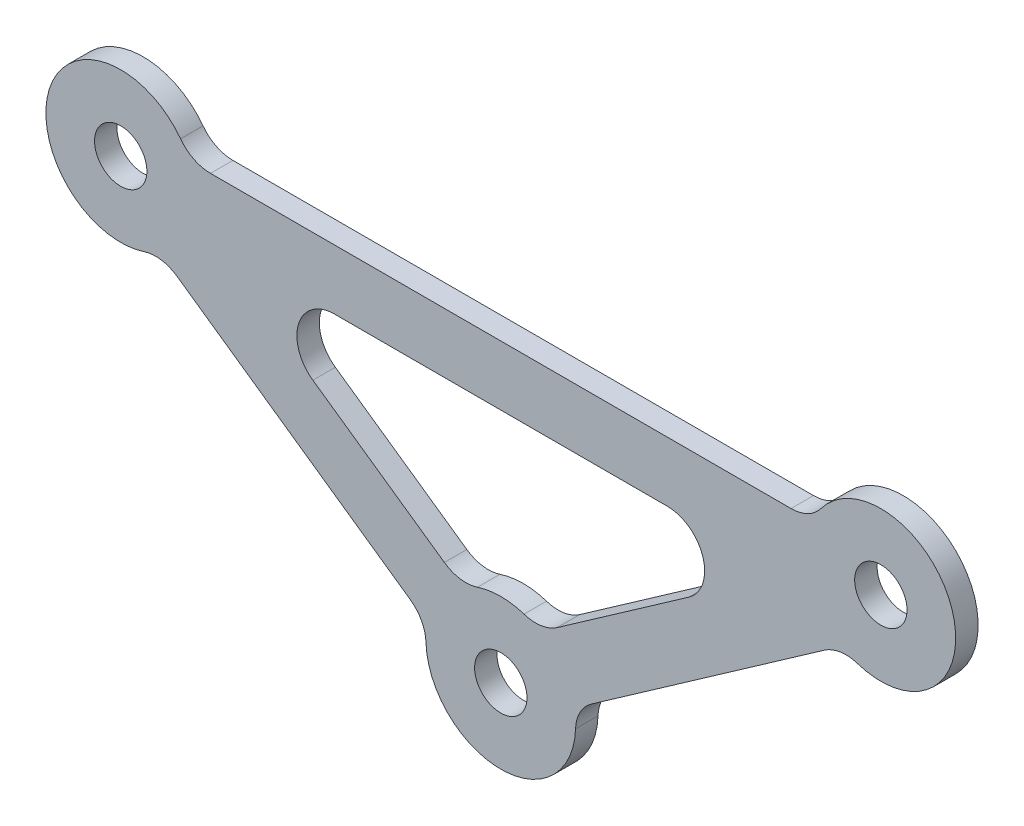
ISO-10303-21;
HEADER;
FILE_DESCRIPTION(('STEP AP214'),'2;1');
FILE_NAME('part.step','',(''),(''),'','','');
FILE_SCHEMA(('AUTOMOTIVE_DESIGN { 1 0 10303 214 1 1 1 1 }'));
ENDSEC;
DATA;
#1=APPLICATION_CONTEXT('core data for automotive mechanical design processes');
#2=APPLICATION_PROTOCOL_DEFINITION('international standard','automotive_design',2000,#1);
#3=PRODUCT_CONTEXT('',#1,'mechanical');
#4=PRODUCT('Part','Part','',(#3));
#5=PRODUCT_RELATED_PRODUCT_CATEGORY('part','',(#4));
#6=PRODUCT_DEFINITION_FORMATION('','',#4);
#7=PRODUCT_DEFINITION_CONTEXT('part definition',#1,'design');
#8=PRODUCT_DEFINITION('design','',#6,#7);
#9=PRODUCT_DEFINITION_SHAPE('','',#8);
#10=(LENGTH_UNIT() NAMED_UNIT(*) SI_UNIT(.MILLI.,.METRE.));
#11=(NAMED_UNIT(*) PLANE_ANGLE_UNIT() SI_UNIT($,.RADIAN.));
#12=(NAMED_UNIT(*) SI_UNIT($,.STERADIAN.) SOLID_ANGLE_UNIT());
#13=UNCERTAINTY_MEASURE_WITH_UNIT(LENGTH_MEASURE(1.E-05),#10,'distance_accuracy_value','');
#14=(GEOMETRIC_REPRESENTATION_CONTEXT(3) GLOBAL_UNCERTAINTY_ASSIGNED_CONTEXT((#13)) GLOBAL_UNIT_ASSIGNED_CONTEXT((#10,
#11,#12)) REPRESENTATION_CONTEXT('',''));
#15=CARTESIAN_POINT('',(0.,0.,0.));
#16=DIRECTION('',(0.,0.,1.));
#17=DIRECTION('',(1.,0.,0.));
#18=AXIS2_PLACEMENT_3D('',#15,#16,#17);
#19=CARTESIAN_POINT('',(38.7874267459177,9.,3.));
#20=DIRECTION('',(0.,0.,1.));
#21=DIRECTION('',(1.,0.,0.));
#22=AXIS2_PLACEMENT_3D('',#19,#20,#21);
#23=PLANE('',#22);
#24=CARTESIAN_POINT('',(-50.7874267459177,0.,3.));
#25=DIRECTION('',(0.,0.,1.));
#26=DIRECTION('',(1.,0.,0.));
#27=AXIS2_PLACEMENT_3D('',#24,#25,#26);
#28=CIRCLE('',#27,3.5);
#29=CARTESIAN_POINT('',(-47.2874267459177,0.,3.));
#30=VERTEX_POINT('',#29);
#31=EDGE_CURVE('E240',#30,#30,#28,.T.);
#32=ORIENTED_EDGE('',*,*,#31,.F.);
#33=EDGE_LOOP('',(#32));
#34=FACE_BOUND('',#33,.T.);
#35=CARTESIAN_POINT('',(38.7874267459177,9.,3.));
#36=DIRECTION('',(0.,0.,-1.));
#37=DIRECTION('',(1.,0.,0.));
#38=AXIS2_PLACEMENT_3D('',#35,#36,#37);
#39=CIRCLE('',#38,5.);
#40=CARTESIAN_POINT('',(42.7874267459177,6.,3.));
#41=VERTEX_POINT('',#40);
#42=CARTESIAN_POINT('',(38.7874267459177,4.,3.));
#43=VERTEX_POINT('',#42);
#44=EDGE_CURVE('E252',#41,#43,#39,.T.);
#45=ORIENTED_EDGE('',*,*,#44,.T.);
#46=DIRECTION('',(-1.,0.,0.));
#47=VECTOR('',#46,1.);
#48=CARTESIAN_POINT('',(-38.7874267459177,4.,3.));
#49=LINE('',#48,#47);
#50=CARTESIAN_POINT('',(-38.7874267459177,4.,3.));
#51=VERTEX_POINT('',#50);
#52=EDGE_CURVE('E255',#43,#51,#49,.T.);
#53=ORIENTED_EDGE('',*,*,#52,.T.);
#54=CARTESIAN_POINT('',(-38.7874267459177,9.,3.));
#55=DIRECTION('',(0.,0.,-1.));
#56=DIRECTION('',(-1.,0.,0.));
#57=AXIS2_PLACEMENT_3D('',#54,#55,#56);
#58=CIRCLE('',#57,5.);
#59=CARTESIAN_POINT('',(-42.7874267459177,6.,3.));
#60=VERTEX_POINT('',#59);
#61=EDGE_CURVE('E258',#51,#60,#58,.T.);
#62=ORIENTED_EDGE('',*,*,#61,.T.);
#63=CARTESIAN_POINT('',(-50.7874267459177,0.,3.));
#64=DIRECTION('',(0.,0.,1.));
#65=DIRECTION('',(1.,0.,0.));
#66=AXIS2_PLACEMENT_3D('',#63,#64,#65);
#67=CIRCLE('',#66,10.);
#68=CARTESIAN_POINT('',(-47.675669009712,-9.50352375654231,3.));
#69=VERTEX_POINT('',#68);
#70=EDGE_CURVE('E260',#60,#69,#67,.T.);
#71=ORIENTED_EDGE('',*,*,#70,.T.);
#72=CARTESIAN_POINT('',(-46.1197901416091,-14.2552856348135,3.));
#73=DIRECTION('',(0.,0.,-1.));
#74=DIRECTION('',(1.,0.,0.));
#75=AXIS2_PLACEMENT_3D('',#72,#73,#74);
#76=CIRCLE('',#75,5.);
#77=CARTESIAN_POINT('',(-43.2519079598539,-10.1595254133685,3.));
#78=VERTEX_POINT('',#77);
#79=EDGE_CURVE('E262',#69,#78,#76,.T.);
#80=ORIENTED_EDGE('',*,*,#79,.T.);
#81=DIRECTION('',(0.819152044288995,-0.573576436351041,0.));
#82=VECTOR('',#81,1.);
#83=CARTESIAN_POINT('',(-12.1241302768721,-31.9554299947081,3.));
#84=LINE('',#83,#82);
#85=CARTESIAN_POINT('',(-12.1241302768721,-31.9554299947081,3.));
#86=VERTEX_POINT('',#85);
#87=EDGE_CURVE('E264',#78,#86,#84,.T.);
#88=ORIENTED_EDGE('',*,*,#87,.T.);
#89=CARTESIAN_POINT('',(-14.9920124586273,-36.051190216153,3.));
#90=DIRECTION('',(0.,0.,-1.));
#91=DIRECTION('',(-1.,0.,0.));
#92=AXIS2_PLACEMENT_3D('',#89,#90,#91);
#93=CIRCLE('',#92,5.);
#94=CARTESIAN_POINT('',(-9.9946749724182,-35.8880398286902,3.));
#95=VERTEX_POINT('',#94);
#96=EDGE_CURVE('E266',#86,#95,#93,.T.);
#97=ORIENTED_EDGE('',*,*,#96,.T.);
#98=CARTESIAN_POINT('',(0.,-35.5617390537646,3.));
#99=DIRECTION('',(0.,0.,1.));
#100=DIRECTION('',(1.,0.,0.));
#101=AXIS2_PLACEMENT_3D('',#98,#99,#100);
#102=CIRCLE('',#101,10.);
#103=CARTESIAN_POINT('',(9.99467497241822,-35.8880398286902,3.));
#104=VERTEX_POINT('',#103);
#105=EDGE_CURVE('E268',#95,#104,#102,.T.);
#106=ORIENTED_EDGE('',*,*,#105,.T.);
#107=CARTESIAN_POINT('',(14.9920124586273,-36.051190216153,3.));
#108=DIRECTION('',(0.,0.,-1.));
#109=DIRECTION('',(1.,0.,0.));
#110=AXIS2_PLACEMENT_3D('',#107,#108,#109);
#111=CIRCLE('',#110,5.);
#112=CARTESIAN_POINT('',(12.1241302768721,-31.9554299947081,3.));
#113=VERTEX_POINT('',#112);
#114=EDGE_CURVE('E270',#104,#113,#111,.T.);
#115=ORIENTED_EDGE('',*,*,#114,.T.);
#116=DIRECTION('',(0.819152044288995,0.573576436351042,0.));
#117=VECTOR('',#116,1.);
#118=CARTESIAN_POINT('',(43.2519079598539,-10.1595254133685,3.));
#119=LINE('',#118,#117);
#120=CARTESIAN_POINT('',(43.2519079598539,-10.1595254133685,3.));
#121=VERTEX_POINT('',#120);
#122=EDGE_CURVE('E272',#113,#121,#119,.T.);
#123=ORIENTED_EDGE('',*,*,#122,.T.);
#124=CARTESIAN_POINT('',(46.1197901416091,-14.2552856348135,3.));
#125=DIRECTION('',(0.,0.,-1.));
#126=DIRECTION('',(-1.,0.,0.));
#127=AXIS2_PLACEMENT_3D('',#124,#125,#126);
#128=CIRCLE('',#127,5.);
#129=CARTESIAN_POINT('',(47.675669009712,-9.5035237565423,3.));
#130=VERTEX_POINT('',#129);
#131=EDGE_CURVE('E274',#121,#130,#128,.T.);
#132=ORIENTED_EDGE('',*,*,#131,.T.);
#133=CARTESIAN_POINT('',(50.7874267459177,0.,3.));
#134=DIRECTION('',(0.,0.,1.));
#135=DIRECTION('',(1.,0.,0.));
#136=AXIS2_PLACEMENT_3D('',#133,#134,#135);
#137=CIRCLE('',#136,10.);
#138=EDGE_CURVE('E276',#130,#41,#137,.T.);
#139=ORIENTED_EDGE('',*,*,#138,.T.);
#140=EDGE_LOOP('',(#45,#53,#62,#71,#80,#88,#97,#106,#115,#123,#132,#139));
#141=FACE_BOUND('',#140,.T.);
#142=CARTESIAN_POINT('',(50.7874267459177,0.,3.));
#143=DIRECTION('',(0.,0.,1.));
#144=DIRECTION('',(1.,0.,0.));
#145=AXIS2_PLACEMENT_3D('',#142,#143,#144);
#146=CIRCLE('',#145,3.5);
#147=CARTESIAN_POINT('',(54.2874267459177,0.,3.));
#148=VERTEX_POINT('',#147);
#149=EDGE_CURVE('E246',#148,#148,#146,.T.);
#150=ORIENTED_EDGE('',*,*,#149,.F.);
#151=EDGE_LOOP('',(#150));
#152=FACE_BOUND('',#151,.T.);
#153=CARTESIAN_POINT('',(0.,-35.5617390537646,3.));
#154=DIRECTION('',(0.,0.,1.));
#155=DIRECTION('',(1.,0.,0.));
#156=AXIS2_PLACEMENT_3D('',#153,#154,#155);
#157=CIRCLE('',#156,3.5);
#158=CARTESIAN_POINT('',(3.50000000000001,-35.5617390537646,3.));
#159=VERTEX_POINT('',#158);
#160=EDGE_CURVE('E234',#159,#159,#157,.T.);
#161=ORIENTED_EDGE('',*,*,#160,.F.);
#162=EDGE_LOOP('',(#161));
#163=FACE_BOUND('',#162,.T.);
#164=DIRECTION('',(0.819152044288995,0.573576436351042,0.));
#165=VECTOR('',#164,1.);
#166=CARTESIAN_POINT('',(25.1109557064036,-13.0957602214451,3.));
#167=LINE('',#166,#165);
#168=CARTESIAN_POINT('',(7.53551878606379,-25.4022136403961,3.));
#169=VERTEX_POINT('',#168);
#170=CARTESIAN_POINT('',(25.1109557064036,-13.0957602214451,3.));
#171=VERTEX_POINT('',#170);
#172=EDGE_CURVE('E177',#169,#171,#167,.T.);
#173=ORIENTED_EDGE('',*,*,#172,.F.);
#174=CARTESIAN_POINT('',(4.66763660430858,-21.3064534189511,3.));
#175=DIRECTION('',(0.,0.,1.));
#176=DIRECTION('',(-1.,0.,0.));
#177=AXIS2_PLACEMENT_3D('',#174,#175,#176);
#178=CIRCLE('',#177,5.);
#179=CARTESIAN_POINT('',(3.11175773620572,-26.0582152972223,3.));
#180=VERTEX_POINT('',#179);
#181=EDGE_CURVE('E169',#180,#169,#178,.T.);
#182=ORIENTED_EDGE('',*,*,#181,.F.);
#183=CARTESIAN_POINT('',(0.,-35.5617390537646,3.));
#184=DIRECTION('',(0.,0.,-1.));
#185=DIRECTION('',(1.,0.,0.));
#186=AXIS2_PLACEMENT_3D('',#183,#184,#185);
#187=CIRCLE('',#186,10.);
#188=CARTESIAN_POINT('',(-3.1117577362057,-26.0582152972223,3.));
#189=VERTEX_POINT('',#188);
#190=EDGE_CURVE('E202',#189,#180,#187,.T.);
#191=ORIENTED_EDGE('',*,*,#190,.F.);
#192=CARTESIAN_POINT('',(-4.66763660430856,-21.3064534189511,3.));
#193=DIRECTION('',(0.,0.,1.));
#194=DIRECTION('',(1.,0.,0.));
#195=AXIS2_PLACEMENT_3D('',#192,#193,#194);
#196=CIRCLE('',#195,5.);
#197=CARTESIAN_POINT('',(-7.53551878606377,-25.4022136403961,3.));
#198=VERTEX_POINT('',#197);
#199=EDGE_CURVE('E200',#198,#189,#196,.T.);
#200=ORIENTED_EDGE('',*,*,#199,.F.);
#201=DIRECTION('',(0.819152044288995,-0.573576436351041,0.));
#202=VECTOR('',#201,1.);
#203=CARTESIAN_POINT('',(-7.53551878606377,-25.4022136403961,3.));
#204=LINE('',#203,#202);
#205=CARTESIAN_POINT('',(-25.1109557064035,-13.0957602214451,3.));
#206=VERTEX_POINT('',#205);
#207=EDGE_CURVE('E198',#206,#198,#204,.T.);
#208=ORIENTED_EDGE('',*,*,#207,.F.);
#209=CARTESIAN_POINT('',(-22.2430735246485,-9.00000000000001,3.));
#210=DIRECTION('',(0.,0.,1.));
#211=DIRECTION('',(1.,0.,0.));
#212=AXIS2_PLACEMENT_3D('',#209,#210,#211);
#213=CIRCLE('',#212,5.);
#214=CARTESIAN_POINT('',(-22.2430735246483,-4.,3.));
#215=VERTEX_POINT('',#214);
#216=EDGE_CURVE('E196',#215,#206,#213,.T.);
#217=ORIENTED_EDGE('',*,*,#216,.F.);
#218=DIRECTION('',(-1.,0.,0.));
#219=VECTOR('',#218,1.);
#220=CARTESIAN_POINT('',(-22.2430735246483,-4.,3.));
#221=LINE('',#220,#219);
#222=CARTESIAN_POINT('',(22.2430735246483,-4.,3.));
#223=VERTEX_POINT('',#222);
#224=EDGE_CURVE('E192',#223,#215,#221,.T.);
#225=ORIENTED_EDGE('',*,*,#224,.F.);
#226=CARTESIAN_POINT('',(22.2430735246485,-9.,3.));
#227=DIRECTION('',(0.,0.,1.));
#228=DIRECTION('',(-1.,0.,0.));
#229=AXIS2_PLACEMENT_3D('',#226,#227,#228);
#230=CIRCLE('',#229,5.);
#231=EDGE_CURVE('E190',#171,#223,#230,.T.);
#232=ORIENTED_EDGE('',*,*,#231,.F.);
#233=EDGE_LOOP('',(#173,#182,#191,#200,#208,#217,#225,#232));
#234=FACE_BOUND('',#233,.T.);
#235=ADVANCED_FACE('F32',(#34,#141,#152,#163,#234),#23,.T.);
#236=CARTESIAN_POINT('',(38.7874267459177,9.,0.));
#237=DIRECTION('',(0.,0.,1.));
#238=DIRECTION('',(1.,0.,0.));
#239=AXIS2_PLACEMENT_3D('',#236,#237,#238);
#240=PLANE('',#239);
#241=CARTESIAN_POINT('',(0.,-35.5617390537646,0.));
#242=DIRECTION('',(0.,0.,1.));
#243=DIRECTION('',(1.,0.,0.));
#244=AXIS2_PLACEMENT_3D('',#241,#242,#243);
#245=CIRCLE('',#244,3.5);
#246=CARTESIAN_POINT('',(3.50000000000001,-35.5617390537646,0.));
#247=VERTEX_POINT('',#246);
#248=EDGE_CURVE('E185',#247,#247,#245,.T.);
#249=ORIENTED_EDGE('',*,*,#248,.T.);
#250=EDGE_LOOP('',(#249));
#251=FACE_BOUND('',#250,.T.);
#252=CARTESIAN_POINT('',(-50.7874267459177,0.,0.));
#253=DIRECTION('',(0.,0.,1.));
#254=DIRECTION('',(1.,0.,0.));
#255=AXIS2_PLACEMENT_3D('',#252,#253,#254);
#256=CIRCLE('',#255,3.5);
#257=CARTESIAN_POINT('',(-47.2874267459177,0.,0.));
#258=VERTEX_POINT('',#257);
#259=EDGE_CURVE('E237',#258,#258,#256,.T.);
#260=ORIENTED_EDGE('',*,*,#259,.T.);
#261=EDGE_LOOP('',(#260));
#262=FACE_BOUND('',#261,.T.);
#263=CARTESIAN_POINT('',(50.7874267459177,0.,0.));
#264=DIRECTION('',(0.,0.,1.));
#265=DIRECTION('',(1.,0.,0.));
#266=AXIS2_PLACEMENT_3D('',#263,#264,#265);
#267=CIRCLE('',#266,3.5);
#268=CARTESIAN_POINT('',(54.2874267459177,0.,0.));
#269=VERTEX_POINT('',#268);
#270=EDGE_CURVE('E243',#269,#269,#267,.T.);
#271=ORIENTED_EDGE('',*,*,#270,.T.);
#272=EDGE_LOOP('',(#271));
#273=FACE_BOUND('',#272,.T.);
#274=CARTESIAN_POINT('',(38.7874267459177,9.,0.));
#275=DIRECTION('',(0.,0.,-1.));
#276=DIRECTION('',(1.,0.,0.));
#277=AXIS2_PLACEMENT_3D('',#274,#275,#276);
#278=CIRCLE('',#277,5.);
#279=CARTESIAN_POINT('',(42.7874267459177,6.,0.));
#280=VERTEX_POINT('',#279);
#281=CARTESIAN_POINT('',(38.7874267459177,4.,0.));
#282=VERTEX_POINT('',#281);
#283=EDGE_CURVE('E249',#280,#282,#278,.T.);
#284=ORIENTED_EDGE('',*,*,#283,.F.);
#285=CARTESIAN_POINT('',(50.7874267459177,0.,0.));
#286=DIRECTION('',(0.,0.,1.));
#287=DIRECTION('',(1.,0.,0.));
#288=AXIS2_PLACEMENT_3D('',#285,#286,#287);
#289=CIRCLE('',#288,10.);
#290=CARTESIAN_POINT('',(47.675669009712,-9.5035237565423,0.));
#291=VERTEX_POINT('',#290);
#292=EDGE_CURVE('E256',#291,#280,#289,.T.);
#293=ORIENTED_EDGE('',*,*,#292,.F.);
#294=CARTESIAN_POINT('',(46.1197901416091,-14.2552856348135,0.));
#295=DIRECTION('',(0.,0.,-1.));
#296=DIRECTION('',(-1.,0.,0.));
#297=AXIS2_PLACEMENT_3D('',#294,#295,#296);
#298=CIRCLE('',#297,5.);
#299=CARTESIAN_POINT('',(43.2519079598539,-10.1595254133685,0.));
#300=VERTEX_POINT('',#299);
#301=EDGE_CURVE('E299',#300,#291,#298,.T.);
#302=ORIENTED_EDGE('',*,*,#301,.F.);
#303=DIRECTION('',(0.819152044288995,0.573576436351042,0.));
#304=VECTOR('',#303,1.);
#305=CARTESIAN_POINT('',(43.2519079598539,-10.1595254133685,0.));
#306=LINE('',#305,#304);
#307=CARTESIAN_POINT('',(12.1241302768721,-31.9554299947081,0.));
#308=VERTEX_POINT('',#307);
#309=EDGE_CURVE('E297',#308,#300,#306,.T.);
#310=ORIENTED_EDGE('',*,*,#309,.F.);
#311=CARTESIAN_POINT('',(14.9920124586273,-36.051190216153,0.));
#312=DIRECTION('',(0.,0.,-1.));
#313=DIRECTION('',(1.,0.,0.));
#314=AXIS2_PLACEMENT_3D('',#311,#312,#313);
#315=CIRCLE('',#314,5.);
#316=CARTESIAN_POINT('',(9.99467497241822,-35.8880398286902,0.));
#317=VERTEX_POINT('',#316);
#318=EDGE_CURVE('E295',#317,#308,#315,.T.);
#319=ORIENTED_EDGE('',*,*,#318,.F.);
#320=CARTESIAN_POINT('',(0.,-35.5617390537646,0.));
#321=DIRECTION('',(0.,0.,1.));
#322=DIRECTION('',(1.,0.,0.));
#323=AXIS2_PLACEMENT_3D('',#320,#321,#322);
#324=CIRCLE('',#323,10.);
#325=CARTESIAN_POINT('',(-9.9946749724182,-35.8880398286902,0.));
#326=VERTEX_POINT('',#325);
#327=EDGE_CURVE('E293',#326,#317,#324,.T.);
#328=ORIENTED_EDGE('',*,*,#327,.F.);
#329=CARTESIAN_POINT('',(-14.9920124586273,-36.051190216153,0.));
#330=DIRECTION('',(0.,0.,-1.));
#331=DIRECTION('',(-1.,0.,0.));
#332=AXIS2_PLACEMENT_3D('',#329,#330,#331);
#333=CIRCLE('',#332,5.);
#334=CARTESIAN_POINT('',(-12.1241302768721,-31.9554299947081,0.));
#335=VERTEX_POINT('',#334);
#336=EDGE_CURVE('E291',#335,#326,#333,.T.);
#337=ORIENTED_EDGE('',*,*,#336,.F.);
#338=DIRECTION('',(0.819152044288995,-0.573576436351041,0.));
#339=VECTOR('',#338,1.);
#340=CARTESIAN_POINT('',(-12.1241302768721,-31.9554299947081,0.));
#341=LINE('',#340,#339);
#342=CARTESIAN_POINT('',(-43.2519079598539,-10.1595254133685,0.));
#343=VERTEX_POINT('',#342);
#344=EDGE_CURVE('E289',#343,#335,#341,.T.);
#345=ORIENTED_EDGE('',*,*,#344,.F.);
#346=CARTESIAN_POINT('',(-46.1197901416091,-14.2552856348135,0.));
#347=DIRECTION('',(0.,0.,-1.));
#348=DIRECTION('',(1.,0.,0.));
#349=AXIS2_PLACEMENT_3D('',#346,#347,#348);
#350=CIRCLE('',#349,5.);
#351=CARTESIAN_POINT('',(-47.675669009712,-9.50352375654231,0.));
#352=VERTEX_POINT('',#351);
#353=EDGE_CURVE('E287',#352,#343,#350,.T.);
#354=ORIENTED_EDGE('',*,*,#353,.F.);
#355=CARTESIAN_POINT('',(-50.7874267459177,0.,0.));
#356=DIRECTION('',(0.,0.,1.));
#357=DIRECTION('',(1.,0.,0.));
#358=AXIS2_PLACEMENT_3D('',#355,#356,#357);
#359=CIRCLE('',#358,10.);
#360=CARTESIAN_POINT('',(-42.7874267459177,6.,0.));
#361=VERTEX_POINT('',#360);
#362=EDGE_CURVE('E285',#361,#352,#359,.T.);
#363=ORIENTED_EDGE('',*,*,#362,.F.);
#364=CARTESIAN_POINT('',(-38.7874267459177,9.,0.));
#365=DIRECTION('',(0.,0.,-1.));
#366=DIRECTION('',(-1.,0.,0.));
#367=AXIS2_PLACEMENT_3D('',#364,#365,#366);
#368=CIRCLE('',#367,5.);
#369=CARTESIAN_POINT('',(-38.7874267459177,4.,0.));
#370=VERTEX_POINT('',#369);
#371=EDGE_CURVE('E283',#370,#361,#368,.T.);
#372=ORIENTED_EDGE('',*,*,#371,.F.);
#373=DIRECTION('',(-1.,0.,0.));
#374=VECTOR('',#373,1.);
#375=CARTESIAN_POINT('',(-38.7874267459177,4.,0.));
#376=LINE('',#375,#374);
#377=EDGE_CURVE('E281',#282,#370,#376,.T.);
#378=ORIENTED_EDGE('',*,*,#377,.F.);
#379=EDGE_LOOP('',(#284,#293,#302,#310,#319,#328,#337,#345,#354,#363,#372,#378));
#380=FACE_BOUND('',#379,.T.);
#381=CARTESIAN_POINT('',(4.66763660430858,-21.3064534189511,0.));
#382=DIRECTION('',(0.,0.,1.));
#383=DIRECTION('',(-1.,0.,0.));
#384=AXIS2_PLACEMENT_3D('',#381,#382,#383);
#385=CIRCLE('',#384,5.);
#386=CARTESIAN_POINT('',(3.11175773620572,-26.0582152972223,0.));
#387=VERTEX_POINT('',#386);
#388=CARTESIAN_POINT('',(7.53551878606379,-25.4022136403961,0.));
#389=VERTEX_POINT('',#388);
#390=EDGE_CURVE('E55',#387,#389,#385,.T.);
#391=ORIENTED_EDGE('',*,*,#390,.T.);
#392=DIRECTION('',(0.819152044288995,0.573576436351042,0.));
#393=VECTOR('',#392,1.);
#394=CARTESIAN_POINT('',(25.1109557064036,-13.0957602214451,0.));
#395=LINE('',#394,#393);
#396=CARTESIAN_POINT('',(25.1109557064036,-13.0957602214451,0.));
#397=VERTEX_POINT('',#396);
#398=EDGE_CURVE('E184',#389,#397,#395,.T.);
#399=ORIENTED_EDGE('',*,*,#398,.T.);
#400=CARTESIAN_POINT('',(22.2430735246485,-9.,0.));
#401=DIRECTION('',(0.,0.,1.));
#402=DIRECTION('',(-1.,0.,0.));
#403=AXIS2_PLACEMENT_3D('',#400,#401,#402);
#404=CIRCLE('',#403,5.);
#405=CARTESIAN_POINT('',(22.2430735246483,-4.,0.));
#406=VERTEX_POINT('',#405);
#407=EDGE_CURVE('E206',#397,#406,#404,.T.);
#408=ORIENTED_EDGE('',*,*,#407,.T.);
#409=DIRECTION('',(-1.,0.,0.));
#410=VECTOR('',#409,1.);
#411=CARTESIAN_POINT('',(-22.2430735246483,-4.,0.));
#412=LINE('',#411,#410);
#413=CARTESIAN_POINT('',(-22.2430735246483,-4.,0.));
#414=VERTEX_POINT('',#413);
#415=EDGE_CURVE('E209',#406,#414,#412,.T.);
#416=ORIENTED_EDGE('',*,*,#415,.T.);
#417=CARTESIAN_POINT('',(-22.2430735246485,-9.00000000000001,0.));
#418=DIRECTION('',(0.,0.,1.));
#419=DIRECTION('',(1.,0.,0.));
#420=AXIS2_PLACEMENT_3D('',#417,#418,#419);
#421=CIRCLE('',#420,5.);
#422=CARTESIAN_POINT('',(-25.1109557064035,-13.0957602214451,0.));
#423=VERTEX_POINT('',#422);
#424=EDGE_CURVE('E212',#414,#423,#421,.T.);
#425=ORIENTED_EDGE('',*,*,#424,.T.);
#426=DIRECTION('',(0.819152044288995,-0.573576436351041,0.));
#427=VECTOR('',#426,1.);
#428=CARTESIAN_POINT('',(-7.53551878606377,-25.4022136403961,0.));
#429=LINE('',#428,#427);
#430=CARTESIAN_POINT('',(-7.53551878606377,-25.4022136403961,0.));
#431=VERTEX_POINT('',#430);
#432=EDGE_CURVE('E215',#423,#431,#429,.T.);
#433=ORIENTED_EDGE('',*,*,#432,.T.);
#434=CARTESIAN_POINT('',(-4.66763660430856,-21.3064534189511,0.));
#435=DIRECTION('',(0.,0.,1.));
#436=DIRECTION('',(1.,0.,0.));
#437=AXIS2_PLACEMENT_3D('',#434,#435,#436);
#438=CIRCLE('',#437,5.);
#439=CARTESIAN_POINT('',(-3.1117577362057,-26.0582152972223,0.));
#440=VERTEX_POINT('',#439);
#441=EDGE_CURVE('E218',#431,#440,#438,.T.);
#442=ORIENTED_EDGE('',*,*,#441,.T.);
#443=CARTESIAN_POINT('',(0.,-35.5617390537646,0.));
#444=DIRECTION('',(0.,0.,-1.));
#445=DIRECTION('',(1.,0.,0.));
#446=AXIS2_PLACEMENT_3D('',#443,#444,#445);
#447=CIRCLE('',#446,10.);
#448=EDGE_CURVE('E178',#440,#387,#447,.T.);
#449=ORIENTED_EDGE('',*,*,#448,.T.);
#450=EDGE_LOOP('',(#391,#399,#408,#416,#425,#433,#442,#449));
#451=FACE_BOUND('',#450,.T.);
#452=ADVANCED_FACE('F341',(#251,#262,#273,#380,#451),#240,.F.);
#453=CARTESIAN_POINT('',(38.7874267459177,9.,3.));
#454=DIRECTION('',(0.,0.,-1.));
#455=DIRECTION('',(-1.,0.,0.));
#456=AXIS2_PLACEMENT_3D('',#453,#454,#455);
#457=CYLINDRICAL_SURFACE('',#456,5.);
#458=ORIENTED_EDGE('',*,*,#283,.T.);
#459=DIRECTION('',(0.,0.,-1.));
#460=VECTOR('',#459,1.);
#461=CARTESIAN_POINT('',(38.7874267459177,4.,3.));
#462=LINE('',#461,#460);
#463=EDGE_CURVE('E11',#43,#282,#462,.T.);
#464=ORIENTED_EDGE('',*,*,#463,.F.);
#465=ORIENTED_EDGE('',*,*,#44,.F.);
#466=DIRECTION('',(0.,0.,-1.));
#467=VECTOR('',#466,1.);
#468=CARTESIAN_POINT('',(42.7874267459177,6.,3.));
#469=LINE('',#468,#467);
#470=EDGE_CURVE('E278',#41,#280,#469,.T.);
#471=ORIENTED_EDGE('',*,*,#470,.T.);
#472=EDGE_LOOP('',(#458,#464,#465,#471));
#473=FACE_BOUND('',#472,.T.);
#474=ADVANCED_FACE('F34',(#473),#457,.F.);
#475=CARTESIAN_POINT('',(-38.7874267459177,4.,3.));
#476=DIRECTION('',(0.,-1.,0.));
#477=DIRECTION('',(1.,0.,0.));
#478=AXIS2_PLACEMENT_3D('',#475,#476,#477);
#479=PLANE('',#478);
#480=ORIENTED_EDGE('',*,*,#377,.T.);
#481=DIRECTION('',(0.,0.,-1.));
#482=VECTOR('',#481,1.);
#483=CARTESIAN_POINT('',(-38.7874267459177,4.,3.));
#484=LINE('',#483,#482);
#485=EDGE_CURVE('E40',#51,#370,#484,.T.);
#486=ORIENTED_EDGE('',*,*,#485,.F.);
#487=ORIENTED_EDGE('',*,*,#52,.F.);
#488=ORIENTED_EDGE('',*,*,#463,.T.);
#489=EDGE_LOOP('',(#480,#486,#487,#488));
#490=FACE_BOUND('',#489,.T.);
#491=ADVANCED_FACE('F359',(#490),#479,.F.);
#492=CARTESIAN_POINT('',(-38.7874267459177,9.,3.));
#493=DIRECTION('',(0.,0.,-1.));
#494=DIRECTION('',(-1.,0.,0.));
#495=AXIS2_PLACEMENT_3D('',#492,#493,#494);
#496=CYLINDRICAL_SURFACE('',#495,5.);
#497=ORIENTED_EDGE('',*,*,#371,.T.);
#498=DIRECTION('',(0.,0.,-1.));
#499=VECTOR('',#498,1.);
#500=CARTESIAN_POINT('',(-42.7874267459177,6.,3.));
#501=LINE('',#500,#499);
#502=EDGE_CURVE('E328',#60,#361,#501,.T.);
#503=ORIENTED_EDGE('',*,*,#502,.F.);
#504=ORIENTED_EDGE('',*,*,#61,.F.);
#505=ORIENTED_EDGE('',*,*,#485,.T.);
#506=EDGE_LOOP('',(#497,#503,#504,#505));
#507=FACE_BOUND('',#506,.T.);
#508=ADVANCED_FACE('F335',(#507),#496,.F.);
#509=CARTESIAN_POINT('',(-50.7874267459177,0.,3.));
#510=DIRECTION('',(0.,0.,-1.));
#511=DIRECTION('',(-1.,0.,0.));
#512=AXIS2_PLACEMENT_3D('',#509,#510,#511);
#513=CYLINDRICAL_SURFACE('',#512,10.);
#514=ORIENTED_EDGE('',*,*,#362,.T.);
#515=DIRECTION('',(0.,0.,-1.));
#516=VECTOR('',#515,1.);
#517=CARTESIAN_POINT('',(-47.675669009712,-9.50352375654231,3.));
#518=LINE('',#517,#516);
#519=EDGE_CURVE('E325',#69,#352,#518,.T.);
#520=ORIENTED_EDGE('',*,*,#519,.F.);
#521=ORIENTED_EDGE('',*,*,#70,.F.);
#522=ORIENTED_EDGE('',*,*,#502,.T.);
#523=EDGE_LOOP('',(#514,#520,#521,#522));
#524=FACE_BOUND('',#523,.T.);
#525=ADVANCED_FACE('F347',(#524),#513,.T.);
#526=CARTESIAN_POINT('',(-46.1197901416091,-14.2552856348135,3.));
#527=DIRECTION('',(0.,0.,-1.));
#528=DIRECTION('',(-1.,0.,0.));
#529=AXIS2_PLACEMENT_3D('',#526,#527,#528);
#530=CYLINDRICAL_SURFACE('',#529,5.);
#531=ORIENTED_EDGE('',*,*,#353,.T.);
#532=DIRECTION('',(0.,0.,-1.));
#533=VECTOR('',#532,1.);
#534=CARTESIAN_POINT('',(-43.2519079598539,-10.1595254133685,3.));
#535=LINE('',#534,#533);
#536=EDGE_CURVE('E322',#78,#343,#535,.T.);
#537=ORIENTED_EDGE('',*,*,#536,.F.);
#538=ORIENTED_EDGE('',*,*,#79,.F.);
#539=ORIENTED_EDGE('',*,*,#519,.T.);
#540=EDGE_LOOP('',(#531,#537,#538,#539));
#541=FACE_BOUND('',#540,.T.);
#542=ADVANCED_FACE('F351',(#541),#530,.F.);
#543=CARTESIAN_POINT('',(-12.1241302768721,-31.9554299947081,3.));
#544=DIRECTION('',(0.573576436351041,0.819152044288995,0.));
#545=DIRECTION('',(-0.819152044288995,0.573576436351041,0.));
#546=AXIS2_PLACEMENT_3D('',#543,#544,#545);
#547=PLANE('',#546);
#548=ORIENTED_EDGE('',*,*,#344,.T.);
#549=DIRECTION('',(0.,0.,-1.));
#550=VECTOR('',#549,1.);
#551=CARTESIAN_POINT('',(-12.1241302768721,-31.9554299947081,3.));
#552=LINE('',#551,#550);
#553=EDGE_CURVE('E319',#86,#335,#552,.T.);
#554=ORIENTED_EDGE('',*,*,#553,.F.);
#555=ORIENTED_EDGE('',*,*,#87,.F.);
#556=ORIENTED_EDGE('',*,*,#536,.T.);
#557=EDGE_LOOP('',(#548,#554,#555,#556));
#558=FACE_BOUND('',#557,.T.);
#559=ADVANCED_FACE('F392',(#558),#547,.F.);
#560=CARTESIAN_POINT('',(-14.9920124586273,-36.051190216153,3.));
#561=DIRECTION('',(0.,0.,-1.));
#562=DIRECTION('',(-1.,0.,0.));
#563=AXIS2_PLACEMENT_3D('',#560,#561,#562);
#564=CYLINDRICAL_SURFACE('',#563,5.);
#565=ORIENTED_EDGE('',*,*,#336,.T.);
#566=DIRECTION('',(0.,0.,-1.));
#567=VECTOR('',#566,1.);
#568=CARTESIAN_POINT('',(-9.9946749724182,-35.8880398286902,3.));
#569=LINE('',#568,#567);
#570=EDGE_CURVE('E316',#95,#326,#569,.T.);
#571=ORIENTED_EDGE('',*,*,#570,.F.);
#572=ORIENTED_EDGE('',*,*,#96,.F.);
#573=ORIENTED_EDGE('',*,*,#553,.T.);
#574=EDGE_LOOP('',(#565,#571,#572,#573));
#575=FACE_BOUND('',#574,.T.);
#576=ADVANCED_FACE('F390',(#575),#564,.F.);
#577=CARTESIAN_POINT('',(0.,-35.5617390537646,3.));
#578=DIRECTION('',(0.,0.,-1.));
#579=DIRECTION('',(-1.,0.,0.));
#580=AXIS2_PLACEMENT_3D('',#577,#578,#579);
#581=CYLINDRICAL_SURFACE('',#580,10.);
#582=ORIENTED_EDGE('',*,*,#327,.T.);
#583=DIRECTION('',(0.,0.,-1.));
#584=VECTOR('',#583,1.);
#585=CARTESIAN_POINT('',(9.99467497241822,-35.8880398286902,3.));
#586=LINE('',#585,#584);
#587=EDGE_CURVE('E313',#104,#317,#586,.T.);
#588=ORIENTED_EDGE('',*,*,#587,.F.);
#589=ORIENTED_EDGE('',*,*,#105,.F.);
#590=ORIENTED_EDGE('',*,*,#570,.T.);
#591=EDGE_LOOP('',(#582,#588,#589,#590));
#592=FACE_BOUND('',#591,.T.);
#593=ADVANCED_FACE('F386',(#592),#581,.T.);
#594=CARTESIAN_POINT('',(14.9920124586273,-36.051190216153,3.));
#595=DIRECTION('',(0.,0.,-1.));
#596=DIRECTION('',(-1.,0.,0.));
#597=AXIS2_PLACEMENT_3D('',#594,#595,#596);
#598=CYLINDRICAL_SURFACE('',#597,5.);
#599=ORIENTED_EDGE('',*,*,#318,.T.);
#600=DIRECTION('',(0.,0.,-1.));
#601=VECTOR('',#600,1.);
#602=CARTESIAN_POINT('',(12.1241302768721,-31.9554299947081,3.));
#603=LINE('',#602,#601);
#604=EDGE_CURVE('E310',#113,#308,#603,.T.);
#605=ORIENTED_EDGE('',*,*,#604,.F.);
#606=ORIENTED_EDGE('',*,*,#114,.F.);
#607=ORIENTED_EDGE('',*,*,#587,.T.);
#608=EDGE_LOOP('',(#599,#605,#606,#607));
#609=FACE_BOUND('',#608,.T.);
#610=ADVANCED_FACE('F381',(#609),#598,.F.);
#611=CARTESIAN_POINT('',(43.2519079598539,-10.1595254133685,3.));
#612=DIRECTION('',(-0.573576436351041,0.819152044288995,0.));
#613=DIRECTION('',(-0.819152044288995,-0.573576436351042,0.));
#614=AXIS2_PLACEMENT_3D('',#611,#612,#613);
#615=PLANE('',#614);
#616=ORIENTED_EDGE('',*,*,#309,.T.);
#617=DIRECTION('',(0.,0.,-1.));
#618=VECTOR('',#617,1.);
#619=CARTESIAN_POINT('',(43.2519079598539,-10.1595254133685,3.));
#620=LINE('',#619,#618);
#621=EDGE_CURVE('E307',#121,#300,#620,.T.);
#622=ORIENTED_EDGE('',*,*,#621,.F.);
#623=ORIENTED_EDGE('',*,*,#122,.F.);
#624=ORIENTED_EDGE('',*,*,#604,.T.);
#625=EDGE_LOOP('',(#616,#622,#623,#624));
#626=FACE_BOUND('',#625,.T.);
#627=ADVANCED_FACE('F375',(#626),#615,.F.);
#628=CARTESIAN_POINT('',(46.1197901416091,-14.2552856348135,3.));
#629=DIRECTION('',(0.,0.,-1.));
#630=DIRECTION('',(-1.,0.,0.));
#631=AXIS2_PLACEMENT_3D('',#628,#629,#630);
#632=CYLINDRICAL_SURFACE('',#631,5.);
#633=ORIENTED_EDGE('',*,*,#301,.T.);
#634=DIRECTION('',(0.,0.,-1.));
#635=VECTOR('',#634,1.);
#636=CARTESIAN_POINT('',(47.675669009712,-9.5035237565423,3.));
#637=LINE('',#636,#635);
#638=EDGE_CURVE('E304',#130,#291,#637,.T.);
#639=ORIENTED_EDGE('',*,*,#638,.F.);
#640=ORIENTED_EDGE('',*,*,#131,.F.);
#641=ORIENTED_EDGE('',*,*,#621,.T.);
#642=EDGE_LOOP('',(#633,#639,#640,#641));
#643=FACE_BOUND('',#642,.T.);
#644=ADVANCED_FACE('F371',(#643),#632,.F.);
#645=CARTESIAN_POINT('',(50.7874267459177,0.,3.));
#646=DIRECTION('',(0.,0.,-1.));
#647=DIRECTION('',(-1.,0.,0.));
#648=AXIS2_PLACEMENT_3D('',#645,#646,#647);
#649=CYLINDRICAL_SURFACE('',#648,10.);
#650=ORIENTED_EDGE('',*,*,#292,.T.);
#651=ORIENTED_EDGE('',*,*,#470,.F.);
#652=ORIENTED_EDGE('',*,*,#138,.F.);
#653=ORIENTED_EDGE('',*,*,#638,.T.);
#654=EDGE_LOOP('',(#650,#651,#652,#653));
#655=FACE_BOUND('',#654,.T.);
#656=ADVANCED_FACE('F366',(#655),#649,.T.);
#657=CARTESIAN_POINT('',(50.7874267459177,0.,3.));
#658=DIRECTION('',(0.,0.,-1.));
#659=DIRECTION('',(-1.,0.,0.));
#660=AXIS2_PLACEMENT_3D('',#657,#658,#659);
#661=CYLINDRICAL_SURFACE('',#660,3.5);
#662=ORIENTED_EDGE('',*,*,#149,.T.);
#663=EDGE_LOOP('',(#662));
#664=FACE_BOUND('',#663,.T.);
#665=ORIENTED_EDGE('',*,*,#270,.F.);
#666=EDGE_LOOP('',(#665));
#667=FACE_BOUND('',#666,.T.);
#668=ADVANCED_FACE('F411',(#664,#667),#661,.F.);
#669=CARTESIAN_POINT('',(-50.7874267459177,0.,3.));
#670=DIRECTION('',(0.,0.,-1.));
#671=DIRECTION('',(-1.,0.,0.));
#672=AXIS2_PLACEMENT_3D('',#669,#670,#671);
#673=CYLINDRICAL_SURFACE('',#672,3.5);
#674=ORIENTED_EDGE('',*,*,#31,.T.);
#675=EDGE_LOOP('',(#674));
#676=FACE_BOUND('',#675,.T.);
#677=ORIENTED_EDGE('',*,*,#259,.F.);
#678=EDGE_LOOP('',(#677));
#679=FACE_BOUND('',#678,.T.);
#680=ADVANCED_FACE('F449',(#676,#679),#673,.F.);
#681=CARTESIAN_POINT('',(0.,-35.5617390537646,3.));
#682=DIRECTION('',(0.,0.,-1.));
#683=DIRECTION('',(-1.,0.,0.));
#684=AXIS2_PLACEMENT_3D('',#681,#682,#683);
#685=CYLINDRICAL_SURFACE('',#684,3.5);
#686=ORIENTED_EDGE('',*,*,#160,.T.);
#687=EDGE_LOOP('',(#686));
#688=FACE_BOUND('',#687,.T.);
#689=ORIENTED_EDGE('',*,*,#248,.F.);
#690=EDGE_LOOP('',(#689));
#691=FACE_BOUND('',#690,.T.);
#692=ADVANCED_FACE('F456',(#688,#691),#685,.F.);
#693=CARTESIAN_POINT('',(4.66763660430858,-21.3064534189511,3.));
#694=DIRECTION('',(0.,0.,-1.));
#695=DIRECTION('',(-1.,0.,0.));
#696=AXIS2_PLACEMENT_3D('',#693,#694,#695);
#697=CYLINDRICAL_SURFACE('',#696,5.);
#698=ORIENTED_EDGE('',*,*,#390,.F.);
#699=DIRECTION('',(0.,0.,-1.));
#700=VECTOR('',#699,1.);
#701=CARTESIAN_POINT('',(3.11175773620572,-26.0582152972223,3.));
#702=LINE('',#701,#700);
#703=EDGE_CURVE('E173',#180,#387,#702,.T.);
#704=ORIENTED_EDGE('',*,*,#703,.F.);
#705=ORIENTED_EDGE('',*,*,#181,.T.);
#706=DIRECTION('',(0.,0.,-1.));
#707=VECTOR('',#706,1.);
#708=CARTESIAN_POINT('',(7.53551878606379,-25.4022136403961,3.));
#709=LINE('',#708,#707);
#710=EDGE_CURVE('E172',#169,#389,#709,.T.);
#711=ORIENTED_EDGE('',*,*,#710,.T.);
#712=EDGE_LOOP('',(#698,#704,#705,#711));
#713=FACE_BOUND('',#712,.T.);
#714=ADVANCED_FACE('F171',(#713),#697,.F.);
#715=CARTESIAN_POINT('',(25.1109557064036,-13.0957602214451,3.));
#716=DIRECTION('',(-0.573576436351042,0.819152044288995,0.));
#717=DIRECTION('',(-0.819152044288995,-0.573576436351042,0.));
#718=AXIS2_PLACEMENT_3D('',#715,#716,#717);
#719=PLANE('',#718);
#720=ORIENTED_EDGE('',*,*,#398,.F.);
#721=ORIENTED_EDGE('',*,*,#710,.F.);
#722=ORIENTED_EDGE('',*,*,#172,.T.);
#723=DIRECTION('',(0.,0.,-1.));
#724=VECTOR('',#723,1.);
#725=CARTESIAN_POINT('',(25.1109557064036,-13.0957602214451,3.));
#726=LINE('',#725,#724);
#727=EDGE_CURVE('E186',#171,#397,#726,.T.);
#728=ORIENTED_EDGE('',*,*,#727,.T.);
#729=EDGE_LOOP('',(#720,#721,#722,#728));
#730=FACE_BOUND('',#729,.T.);
#731=ADVANCED_FACE('F181',(#730),#719,.T.);
#732=CARTESIAN_POINT('',(22.2430735246485,-9.,3.));
#733=DIRECTION('',(0.,0.,-1.));
#734=DIRECTION('',(-1.,0.,0.));
#735=AXIS2_PLACEMENT_3D('',#732,#733,#734);
#736=CYLINDRICAL_SURFACE('',#735,5.);
#737=ORIENTED_EDGE('',*,*,#407,.F.);
#738=ORIENTED_EDGE('',*,*,#727,.F.);
#739=ORIENTED_EDGE('',*,*,#231,.T.);
#740=DIRECTION('',(0.,0.,-1.));
#741=VECTOR('',#740,1.);
#742=CARTESIAN_POINT('',(22.2430735246483,-4.,3.));
#743=LINE('',#742,#741);
#744=EDGE_CURVE('E231',#223,#406,#743,.T.);
#745=ORIENTED_EDGE('',*,*,#744,.T.);
#746=EDGE_LOOP('',(#737,#738,#739,#745));
#747=FACE_BOUND('',#746,.T.);
#748=ADVANCED_FACE('F476',(#747),#736,.F.);
#749=CARTESIAN_POINT('',(-22.2430735246483,-4.,3.));
#750=DIRECTION('',(0.,-1.,0.));
#751=DIRECTION('',(1.,0.,0.));
#752=AXIS2_PLACEMENT_3D('',#749,#750,#751);
#753=PLANE('',#752);
#754=ORIENTED_EDGE('',*,*,#415,.F.);
#755=ORIENTED_EDGE('',*,*,#744,.F.);
#756=ORIENTED_EDGE('',*,*,#224,.T.);
#757=DIRECTION('',(0.,0.,-1.));
#758=VECTOR('',#757,1.);
#759=CARTESIAN_POINT('',(-22.2430735246483,-4.,3.));
#760=LINE('',#759,#758);
#761=EDGE_CURVE('E229',#215,#414,#760,.T.);
#762=ORIENTED_EDGE('',*,*,#761,.T.);
#763=EDGE_LOOP('',(#754,#755,#756,#762));
#764=FACE_BOUND('',#763,.T.);
#765=ADVANCED_FACE('F483',(#764),#753,.T.);
#766=CARTESIAN_POINT('',(-22.2430735246485,-9.00000000000001,3.));
#767=DIRECTION('',(0.,0.,-1.));
#768=DIRECTION('',(-1.,0.,0.));
#769=AXIS2_PLACEMENT_3D('',#766,#767,#768);
#770=CYLINDRICAL_SURFACE('',#769,5.);
#771=ORIENTED_EDGE('',*,*,#424,.F.);
#772=ORIENTED_EDGE('',*,*,#761,.F.);
#773=ORIENTED_EDGE('',*,*,#216,.T.);
#774=DIRECTION('',(0.,0.,-1.));
#775=VECTOR('',#774,1.);
#776=CARTESIAN_POINT('',(-25.1109557064035,-13.0957602214451,3.));
#777=LINE('',#776,#775);
#778=EDGE_CURVE('E227',#206,#423,#777,.T.);
#779=ORIENTED_EDGE('',*,*,#778,.T.);
#780=EDGE_LOOP('',(#771,#772,#773,#779));
#781=FACE_BOUND('',#780,.T.);
#782=ADVANCED_FACE('F491',(#781),#770,.F.);
#783=CARTESIAN_POINT('',(-7.53551878606377,-25.4022136403961,3.));
#784=DIRECTION('',(0.573576436351041,0.819152044288995,0.));
#785=DIRECTION('',(-0.819152044288995,0.573576436351041,0.));
#786=AXIS2_PLACEMENT_3D('',#783,#784,#785);
#787=PLANE('',#786);
#788=ORIENTED_EDGE('',*,*,#432,.F.);
#789=ORIENTED_EDGE('',*,*,#778,.F.);
#790=ORIENTED_EDGE('',*,*,#207,.T.);
#791=DIRECTION('',(0.,0.,-1.));
#792=VECTOR('',#791,1.);
#793=CARTESIAN_POINT('',(-7.53551878606377,-25.4022136403961,3.));
#794=LINE('',#793,#792);
#795=EDGE_CURVE('E225',#198,#431,#794,.T.);
#796=ORIENTED_EDGE('',*,*,#795,.T.);
#797=EDGE_LOOP('',(#788,#789,#790,#796));
#798=FACE_BOUND('',#797,.T.);
#799=ADVANCED_FACE('F499',(#798),#787,.T.);
#800=CARTESIAN_POINT('',(-4.66763660430856,-21.3064534189511,3.));
#801=DIRECTION('',(0.,0.,-1.));
#802=DIRECTION('',(-1.,0.,0.));
#803=AXIS2_PLACEMENT_3D('',#800,#801,#802);
#804=CYLINDRICAL_SURFACE('',#803,5.);
#805=ORIENTED_EDGE('',*,*,#441,.F.);
#806=ORIENTED_EDGE('',*,*,#795,.F.);
#807=ORIENTED_EDGE('',*,*,#199,.T.);
#808=DIRECTION('',(0.,0.,-1.));
#809=VECTOR('',#808,1.);
#810=CARTESIAN_POINT('',(-3.1117577362057,-26.0582152972223,3.));
#811=LINE('',#810,#809);
#812=EDGE_CURVE('E47',#189,#440,#811,.T.);
#813=ORIENTED_EDGE('',*,*,#812,.T.);
#814=EDGE_LOOP('',(#805,#806,#807,#813));
#815=FACE_BOUND('',#814,.T.);
#816=ADVANCED_FACE('F507',(#815),#804,.F.);
#817=CARTESIAN_POINT('',(0.,-35.5617390537646,3.));
#818=DIRECTION('',(0.,0.,-1.));
#819=DIRECTION('',(-1.,0.,0.));
#820=AXIS2_PLACEMENT_3D('',#817,#818,#819);
#821=CYLINDRICAL_SURFACE('',#820,10.);
#822=ORIENTED_EDGE('',*,*,#448,.F.);
#823=ORIENTED_EDGE('',*,*,#812,.F.);
#824=ORIENTED_EDGE('',*,*,#190,.T.);
#825=ORIENTED_EDGE('',*,*,#703,.T.);
#826=EDGE_LOOP('',(#822,#823,#824,#825));
#827=FACE_BOUND('',#826,.T.);
#828=ADVANCED_FACE('F515',(#827),#821,.T.);
#829=CLOSED_SHELL('',(#235,#452,#474,#491,#508,#525,#542,#559,#576,#593,#610,#627,#644,#656,
#668,#680,#692,#714,#731,#748,#765,#782,#799,#816,#828));
#830=MANIFOLD_SOLID_BREP('B2',#829);
#831=ADVANCED_BREP_SHAPE_REPRESENTATION('',(#18,#830),#14);
#832=SHAPE_DEFINITION_REPRESENTATION(#9,#831);
ENDSEC;
END-ISO-10303-21;
